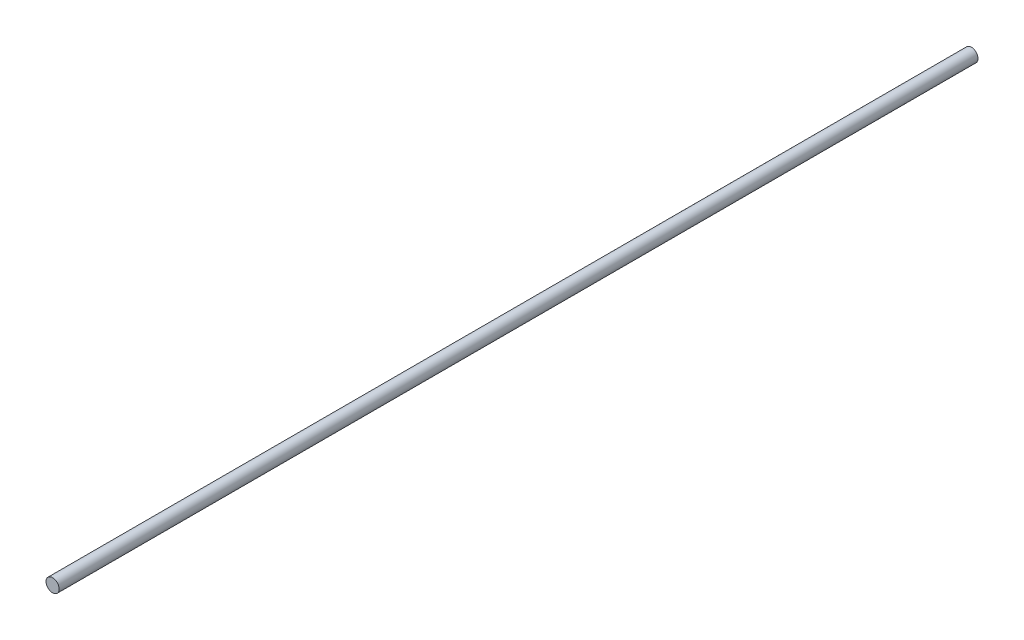
ISO-10303-21;
HEADER;
FILE_DESCRIPTION(('STEP AP214'),'2;1');
FILE_NAME('part.step','',(''),(''),'','','');
FILE_SCHEMA(('AUTOMOTIVE_DESIGN { 1 0 10303 214 1 1 1 1 }'));
ENDSEC;
DATA;
#1=APPLICATION_CONTEXT('core data for automotive mechanical design processes');
#2=APPLICATION_PROTOCOL_DEFINITION('international standard','automotive_design',2000,#1);
#3=PRODUCT_CONTEXT('',#1,'mechanical');
#4=PRODUCT('Part','Part','',(#3));
#5=PRODUCT_RELATED_PRODUCT_CATEGORY('part','',(#4));
#6=PRODUCT_DEFINITION_FORMATION('','',#4);
#7=PRODUCT_DEFINITION_CONTEXT('part definition',#1,'design');
#8=PRODUCT_DEFINITION('design','',#6,#7);
#9=PRODUCT_DEFINITION_SHAPE('','',#8);
#10=(LENGTH_UNIT() NAMED_UNIT(*) SI_UNIT(.MILLI.,.METRE.));
#11=(NAMED_UNIT(*) PLANE_ANGLE_UNIT() SI_UNIT($,.RADIAN.));
#12=(NAMED_UNIT(*) SI_UNIT($,.STERADIAN.) SOLID_ANGLE_UNIT());
#13=UNCERTAINTY_MEASURE_WITH_UNIT(LENGTH_MEASURE(1.E-05),#10,'distance_accuracy_value','');
#14=(GEOMETRIC_REPRESENTATION_CONTEXT(3) GLOBAL_UNCERTAINTY_ASSIGNED_CONTEXT((#13)) GLOBAL_UNIT_ASSIGNED_CONTEXT((#10,
#11,#12)) REPRESENTATION_CONTEXT('',''));
#15=CARTESIAN_POINT('',(0.,0.,0.));
#16=DIRECTION('',(0.,0.,1.));
#17=DIRECTION('',(1.,0.,0.));
#18=AXIS2_PLACEMENT_3D('',#15,#16,#17);
#19=CARTESIAN_POINT('',(0.,0.,558.8));
#20=DIRECTION('',(0.,0.,-1.));
#21=DIRECTION('',(-1.,0.,0.));
#22=AXIS2_PLACEMENT_3D('',#19,#20,#21);
#23=CYLINDRICAL_SURFACE('',#22,4.);
#24=CARTESIAN_POINT('',(0.,0.,558.8));
#25=DIRECTION('',(0.,0.,1.));
#26=DIRECTION('',(1.,0.,0.));
#27=AXIS2_PLACEMENT_3D('',#24,#25,#26);
#28=CIRCLE('',#27,4.);
#29=CARTESIAN_POINT('',(4.,0.,558.8));
#30=VERTEX_POINT('',#29);
#31=EDGE_CURVE('E10',#30,#30,#28,.T.);
#32=ORIENTED_EDGE('',*,*,#31,.F.);
#33=EDGE_LOOP('',(#32));
#34=FACE_BOUND('',#33,.T.);
#35=CARTESIAN_POINT('',(0.,0.,0.));
#36=DIRECTION('',(0.,0.,1.));
#37=DIRECTION('',(1.,0.,0.));
#38=AXIS2_PLACEMENT_3D('',#35,#36,#37);
#39=CIRCLE('',#38,4.);
#40=CARTESIAN_POINT('',(4.,0.,0.));
#41=VERTEX_POINT('',#40);
#42=EDGE_CURVE('E34',#41,#41,#39,.T.);
#43=ORIENTED_EDGE('',*,*,#42,.T.);
#44=EDGE_LOOP('',(#43));
#45=FACE_BOUND('',#44,.T.);
#46=ADVANCED_FACE('F31',(#34,#45),#23,.T.);
#47=CARTESIAN_POINT('',(0.,0.,558.8));
#48=DIRECTION('',(0.,0.,1.));
#49=DIRECTION('',(1.,0.,0.));
#50=AXIS2_PLACEMENT_3D('',#47,#48,#49);
#51=PLANE('',#50);
#52=ORIENTED_EDGE('',*,*,#31,.T.);
#53=EDGE_LOOP('',(#52));
#54=FACE_BOUND('',#53,.T.);
#55=ADVANCED_FACE('F46',(#54),#51,.T.);
#56=CARTESIAN_POINT('',(0.,0.,0.));
#57=DIRECTION('',(0.,0.,1.));
#58=DIRECTION('',(1.,0.,0.));
#59=AXIS2_PLACEMENT_3D('',#56,#57,#58);
#60=PLANE('',#59);
#61=ORIENTED_EDGE('',*,*,#42,.F.);
#62=EDGE_LOOP('',(#61));
#63=FACE_BOUND('',#62,.T.);
#64=ADVANCED_FACE('F44',(#63),#60,.F.);
#65=CLOSED_SHELL('',(#46,#55,#64));
#66=MANIFOLD_SOLID_BREP('B2',#65);
#67=ADVANCED_BREP_SHAPE_REPRESENTATION('',(#18,#66),#14);
#68=SHAPE_DEFINITION_REPRESENTATION(#9,#67);
ENDSEC;
END-ISO-10303-21;
